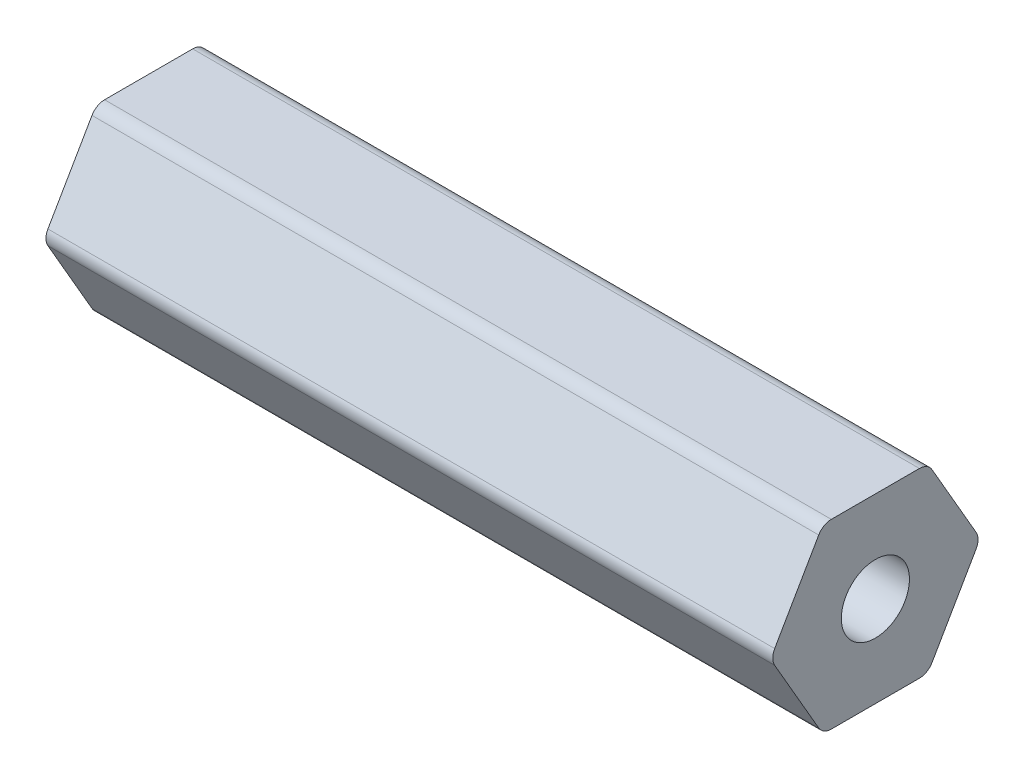
ISO-10303-21;
HEADER;
FILE_DESCRIPTION(('STEP AP214'),'2;1');
FILE_NAME('part.step','',(''),(''),'','','');
FILE_SCHEMA(('AUTOMOTIVE_DESIGN { 1 0 10303 214 1 1 1 1 }'));
ENDSEC;
DATA;
#1=APPLICATION_CONTEXT('core data for automotive mechanical design processes');
#2=APPLICATION_PROTOCOL_DEFINITION('international standard','automotive_design',2000,#1);
#3=PRODUCT_CONTEXT('',#1,'mechanical');
#4=PRODUCT('Part','Part','',(#3));
#5=PRODUCT_RELATED_PRODUCT_CATEGORY('part','',(#4));
#6=PRODUCT_DEFINITION_FORMATION('','',#4);
#7=PRODUCT_DEFINITION_CONTEXT('part definition',#1,'design');
#8=PRODUCT_DEFINITION('design','',#6,#7);
#9=PRODUCT_DEFINITION_SHAPE('','',#8);
#10=(LENGTH_UNIT() NAMED_UNIT(*) SI_UNIT(.MILLI.,.METRE.));
#11=(NAMED_UNIT(*) PLANE_ANGLE_UNIT() SI_UNIT($,.RADIAN.));
#12=(NAMED_UNIT(*) SI_UNIT($,.STERADIAN.) SOLID_ANGLE_UNIT());
#13=UNCERTAINTY_MEASURE_WITH_UNIT(LENGTH_MEASURE(1.E-05),#10,'distance_accuracy_value','');
#14=(GEOMETRIC_REPRESENTATION_CONTEXT(3) GLOBAL_UNCERTAINTY_ASSIGNED_CONTEXT((#13)) GLOBAL_UNIT_ASSIGNED_CONTEXT((#10,
#11,#12)) REPRESENTATION_CONTEXT('',''));
#15=CARTESIAN_POINT('',(0.,0.,0.));
#16=DIRECTION('',(0.,0.,1.));
#17=DIRECTION('',(1.,0.,0.));
#18=AXIS2_PLACEMENT_3D('',#15,#16,#17);
#19=CARTESIAN_POINT('',(50.8,5.334,-3.07958633585748));
#20=DIRECTION('',(-1.,0.,0.));
#21=DIRECTION('',(0.,0.,1.));
#22=AXIS2_PLACEMENT_3D('',#19,#20,#21);
#23=PLANE('',#22);
#24=CARTESIAN_POINT('',(50.8,5.334,-3.07958633585748));
#25=DIRECTION('',(1.,0.,0.));
#26=DIRECTION('',(0.,0.,1.));
#27=AXIS2_PLACEMENT_3D('',#24,#25,#26);
#28=CIRCLE('',#27,1.016);
#29=CARTESIAN_POINT('',(50.8,5.84199999999999,-3.95946814610247));
#30=VERTEX_POINT('',#29);
#31=CARTESIAN_POINT('',(50.8,6.34999999999999,-3.07958633585748));
#32=VERTEX_POINT('',#31);
#33=EDGE_CURVE('E206',#30,#32,#28,.T.);
#34=ORIENTED_EDGE('',*,*,#33,.T.);
#35=DIRECTION('',(0.,0.,1.));
#36=VECTOR('',#35,1.);
#37=CARTESIAN_POINT('',(50.8,6.34999999999999,-3.07958633585748));
#38=LINE('',#37,#36);
#39=CARTESIAN_POINT('',(50.8,6.35000000000001,3.07958633585745));
#40=VERTEX_POINT('',#39);
#41=EDGE_CURVE('E118',#32,#40,#38,.T.);
#42=ORIENTED_EDGE('',*,*,#41,.T.);
#43=CARTESIAN_POINT('',(50.8,5.33400000000001,3.07958633585745));
#44=DIRECTION('',(1.,0.,0.));
#45=DIRECTION('',(0.,0.,1.));
#46=AXIS2_PLACEMENT_3D('',#43,#44,#45);
#47=CIRCLE('',#46,1.016);
#48=CARTESIAN_POINT('',(50.8,5.84200000000001,3.95946814610244));
#49=VERTEX_POINT('',#48);
#50=EDGE_CURVE('E243',#40,#49,#47,.T.);
#51=ORIENTED_EDGE('',*,*,#50,.T.);
#52=DIRECTION('',(0.,-0.866025403784437,0.500000000000003));
#53=VECTOR('',#52,1.);
#54=CARTESIAN_POINT('',(50.8,5.84200000000001,3.95946814610244));
#55=LINE('',#54,#53);
#56=CARTESIAN_POINT('',(50.8,0.508000000000022,7.03905448195992));
#57=VERTEX_POINT('',#56);
#58=EDGE_CURVE('E263',#49,#57,#55,.T.);
#59=ORIENTED_EDGE('',*,*,#58,.T.);
#60=CARTESIAN_POINT('',(50.8,0.,6.15917267171493));
#61=DIRECTION('',(1.,0.,0.));
#62=DIRECTION('',(0.,0.,1.));
#63=AXIS2_PLACEMENT_3D('',#60,#61,#62);
#64=CIRCLE('',#63,1.016);
#65=CARTESIAN_POINT('',(50.8,-0.50799999999998,7.03905448195993));
#66=VERTEX_POINT('',#65);
#67=EDGE_CURVE('E259',#57,#66,#64,.T.);
#68=ORIENTED_EDGE('',*,*,#67,.T.);
#69=DIRECTION('',(0.,-0.86602540378444,-0.499999999999998));
#70=VECTOR('',#69,1.);
#71=CARTESIAN_POINT('',(50.8,-0.507999999999979,7.03905448195992));
#72=LINE('',#71,#70);
#73=CARTESIAN_POINT('',(50.8,-5.84199999999999,3.95946814610247));
#74=VERTEX_POINT('',#73);
#75=EDGE_CURVE('E262',#66,#74,#72,.T.);
#76=ORIENTED_EDGE('',*,*,#75,.T.);
#77=CARTESIAN_POINT('',(50.8,-5.334,3.07958633585748));
#78=DIRECTION('',(1.,0.,0.));
#79=DIRECTION('',(0.,0.,1.));
#80=AXIS2_PLACEMENT_3D('',#77,#78,#79);
#81=CIRCLE('',#80,1.016);
#82=CARTESIAN_POINT('',(50.8,-6.35,3.07958633585748));
#83=VERTEX_POINT('',#82);
#84=EDGE_CURVE('E267',#74,#83,#81,.T.);
#85=ORIENTED_EDGE('',*,*,#84,.T.);
#86=DIRECTION('',(0.,0.,-1.));
#87=VECTOR('',#86,1.);
#88=CARTESIAN_POINT('',(50.8,-6.35,3.07958633585748));
#89=LINE('',#88,#87);
#90=CARTESIAN_POINT('',(50.8,-6.35000000000001,-3.07958633585745));
#91=VERTEX_POINT('',#90);
#92=EDGE_CURVE('E274',#83,#91,#89,.T.);
#93=ORIENTED_EDGE('',*,*,#92,.T.);
#94=CARTESIAN_POINT('',(50.8,-5.33400000000001,-3.07958633585745));
#95=DIRECTION('',(1.,0.,0.));
#96=DIRECTION('',(0.,0.,1.));
#97=AXIS2_PLACEMENT_3D('',#94,#95,#96);
#98=CIRCLE('',#97,1.016);
#99=CARTESIAN_POINT('',(50.8,-5.84200000000001,-3.95946814610244));
#100=VERTEX_POINT('',#99);
#101=EDGE_CURVE('E149',#91,#100,#98,.T.);
#102=ORIENTED_EDGE('',*,*,#101,.T.);
#103=DIRECTION('',(0.,0.866025403784437,-0.500000000000002));
#104=VECTOR('',#103,1.);
#105=CARTESIAN_POINT('',(50.8,-5.84200000000001,-3.95946814610244));
#106=LINE('',#105,#104);
#107=CARTESIAN_POINT('',(50.8,-0.508000000000019,-7.03905448195992));
#108=VERTEX_POINT('',#107);
#109=EDGE_CURVE('E143',#100,#108,#106,.T.);
#110=ORIENTED_EDGE('',*,*,#109,.T.);
#111=CARTESIAN_POINT('',(50.8,0.,-6.15917267171493));
#112=DIRECTION('',(1.,0.,0.));
#113=DIRECTION('',(0.,0.,1.));
#114=AXIS2_PLACEMENT_3D('',#111,#112,#113);
#115=CIRCLE('',#114,1.016);
#116=CARTESIAN_POINT('',(50.8,0.507999999999981,-7.03905448195992));
#117=VERTEX_POINT('',#116);
#118=EDGE_CURVE('E147',#108,#117,#115,.T.);
#119=ORIENTED_EDGE('',*,*,#118,.T.);
#120=DIRECTION('',(0.,0.86602540378444,0.499999999999997));
#121=VECTOR('',#120,1.);
#122=CARTESIAN_POINT('',(50.8,0.50799999999998,-7.03905448195992));
#123=LINE('',#122,#121);
#124=EDGE_CURVE('E63',#117,#30,#123,.T.);
#125=ORIENTED_EDGE('',*,*,#124,.T.);
#126=EDGE_LOOP('',(#34,#42,#51,#59,#68,#76,#85,#93,#102,#110,#119,#125));
#127=FACE_BOUND('',#126,.T.);
#128=CARTESIAN_POINT('',(50.8,0.,0.));
#129=DIRECTION('',(1.,0.,0.));
#130=DIRECTION('',(0.,0.,-1.));
#131=AXIS2_PLACEMENT_3D('',#128,#129,#130);
#132=CIRCLE('',#131,2.38125);
#133=CARTESIAN_POINT('',(50.8,0.,-2.38125));
#134=VERTEX_POINT('',#133);
#135=EDGE_CURVE('E176',#134,#134,#132,.T.);
#136=ORIENTED_EDGE('',*,*,#135,.F.);
#137=EDGE_LOOP('',(#136));
#138=FACE_BOUND('',#137,.T.);
#139=ADVANCED_FACE('F45',(#127,#138),#23,.F.);
#140=CARTESIAN_POINT('',(0.,5.334,-3.07958633585748));
#141=DIRECTION('',(-1.,0.,0.));
#142=DIRECTION('',(0.,0.,1.));
#143=AXIS2_PLACEMENT_3D('',#140,#141,#142);
#144=PLANE('',#143);
#145=CARTESIAN_POINT('',(0.,5.334,-3.07958633585748));
#146=DIRECTION('',(1.,0.,0.));
#147=DIRECTION('',(0.,0.,1.));
#148=AXIS2_PLACEMENT_3D('',#145,#146,#147);
#149=CIRCLE('',#148,1.016);
#150=CARTESIAN_POINT('',(0.,5.84199999999999,-3.95946814610247));
#151=VERTEX_POINT('',#150);
#152=CARTESIAN_POINT('',(0.,6.34999999999999,-3.07958633585748));
#153=VERTEX_POINT('',#152);
#154=EDGE_CURVE('E171',#151,#153,#149,.T.);
#155=ORIENTED_EDGE('',*,*,#154,.F.);
#156=DIRECTION('',(0.,0.86602540378444,0.499999999999997));
#157=VECTOR('',#156,1.);
#158=CARTESIAN_POINT('',(0.,0.50799999999998,-7.03905448195992));
#159=LINE('',#158,#157);
#160=CARTESIAN_POINT('',(0.,0.507999999999981,-7.03905448195992));
#161=VERTEX_POINT('',#160);
#162=EDGE_CURVE('E110',#161,#151,#159,.T.);
#163=ORIENTED_EDGE('',*,*,#162,.F.);
#164=CARTESIAN_POINT('',(0.,0.,-6.15917267171493));
#165=DIRECTION('',(1.,0.,0.));
#166=DIRECTION('',(0.,0.,1.));
#167=AXIS2_PLACEMENT_3D('',#164,#165,#166);
#168=CIRCLE('',#167,1.016);
#169=CARTESIAN_POINT('',(0.,-0.508000000000019,-7.03905448195992));
#170=VERTEX_POINT('',#169);
#171=EDGE_CURVE('E104',#170,#161,#168,.T.);
#172=ORIENTED_EDGE('',*,*,#171,.F.);
#173=DIRECTION('',(0.,0.866025403784437,-0.500000000000002));
#174=VECTOR('',#173,1.);
#175=CARTESIAN_POINT('',(0.,-5.84200000000001,-3.95946814610244));
#176=LINE('',#175,#174);
#177=CARTESIAN_POINT('',(0.,-5.84200000000001,-3.95946814610244));
#178=VERTEX_POINT('',#177);
#179=EDGE_CURVE('E158',#178,#170,#176,.T.);
#180=ORIENTED_EDGE('',*,*,#179,.F.);
#181=CARTESIAN_POINT('',(0.,-5.33400000000001,-3.07958633585745));
#182=DIRECTION('',(1.,0.,0.));
#183=DIRECTION('',(0.,0.,1.));
#184=AXIS2_PLACEMENT_3D('',#181,#182,#183);
#185=CIRCLE('',#184,1.016);
#186=CARTESIAN_POINT('',(0.,-6.35000000000001,-3.07958633585745));
#187=VERTEX_POINT('',#186);
#188=EDGE_CURVE('E197',#187,#178,#185,.T.);
#189=ORIENTED_EDGE('',*,*,#188,.F.);
#190=DIRECTION('',(0.,0.,-1.));
#191=VECTOR('',#190,1.);
#192=CARTESIAN_POINT('',(0.,-6.35,3.07958633585748));
#193=LINE('',#192,#191);
#194=CARTESIAN_POINT('',(0.,-6.35,3.07958633585748));
#195=VERTEX_POINT('',#194);
#196=EDGE_CURVE('E194',#195,#187,#193,.T.);
#197=ORIENTED_EDGE('',*,*,#196,.F.);
#198=CARTESIAN_POINT('',(0.,-5.334,3.07958633585748));
#199=DIRECTION('',(1.,0.,0.));
#200=DIRECTION('',(0.,0.,1.));
#201=AXIS2_PLACEMENT_3D('',#198,#199,#200);
#202=CIRCLE('',#201,1.016);
#203=CARTESIAN_POINT('',(0.,-5.84199999999999,3.95946814610247));
#204=VERTEX_POINT('',#203);
#205=EDGE_CURVE('E191',#204,#195,#202,.T.);
#206=ORIENTED_EDGE('',*,*,#205,.F.);
#207=DIRECTION('',(0.,-0.86602540378444,-0.499999999999998));
#208=VECTOR('',#207,1.);
#209=CARTESIAN_POINT('',(0.,-0.507999999999979,7.03905448195992));
#210=LINE('',#209,#208);
#211=CARTESIAN_POINT('',(0.,-0.50799999999998,7.03905448195993));
#212=VERTEX_POINT('',#211);
#213=EDGE_CURVE('E188',#212,#204,#210,.T.);
#214=ORIENTED_EDGE('',*,*,#213,.F.);
#215=CARTESIAN_POINT('',(0.,0.,6.15917267171493));
#216=DIRECTION('',(1.,0.,0.));
#217=DIRECTION('',(0.,0.,1.));
#218=AXIS2_PLACEMENT_3D('',#215,#216,#217);
#219=CIRCLE('',#218,1.016);
#220=CARTESIAN_POINT('',(0.,0.508000000000022,7.03905448195992));
#221=VERTEX_POINT('',#220);
#222=EDGE_CURVE('E185',#221,#212,#219,.T.);
#223=ORIENTED_EDGE('',*,*,#222,.F.);
#224=DIRECTION('',(0.,-0.866025403784437,0.500000000000003));
#225=VECTOR('',#224,1.);
#226=CARTESIAN_POINT('',(0.,5.84200000000001,3.95946814610244));
#227=LINE('',#226,#225);
#228=CARTESIAN_POINT('',(0.,5.84200000000001,3.95946814610244));
#229=VERTEX_POINT('',#228);
#230=EDGE_CURVE('E182',#229,#221,#227,.T.);
#231=ORIENTED_EDGE('',*,*,#230,.F.);
#232=CARTESIAN_POINT('',(0.,5.33400000000001,3.07958633585745));
#233=DIRECTION('',(1.,0.,0.));
#234=DIRECTION('',(0.,0.,1.));
#235=AXIS2_PLACEMENT_3D('',#232,#233,#234);
#236=CIRCLE('',#235,1.016);
#237=CARTESIAN_POINT('',(0.,6.35000000000001,3.07958633585745));
#238=VERTEX_POINT('',#237);
#239=EDGE_CURVE('E179',#238,#229,#236,.T.);
#240=ORIENTED_EDGE('',*,*,#239,.F.);
#241=DIRECTION('',(0.,0.,1.));
#242=VECTOR('',#241,1.);
#243=CARTESIAN_POINT('',(0.,6.34999999999999,-3.07958633585748));
#244=LINE('',#243,#242);
#245=EDGE_CURVE('E175',#153,#238,#244,.T.);
#246=ORIENTED_EDGE('',*,*,#245,.F.);
#247=EDGE_LOOP('',(#155,#163,#172,#180,#189,#197,#206,#214,#223,#231,#240,#246));
#248=FACE_BOUND('',#247,.T.);
#249=CARTESIAN_POINT('',(0.,0.,0.));
#250=DIRECTION('',(1.,0.,0.));
#251=DIRECTION('',(0.,0.,-1.));
#252=AXIS2_PLACEMENT_3D('',#249,#250,#251);
#253=CIRCLE('',#252,2.38125);
#254=CARTESIAN_POINT('',(0.,0.,-2.38125));
#255=VERTEX_POINT('',#254);
#256=EDGE_CURVE('E474',#255,#255,#253,.T.);
#257=ORIENTED_EDGE('',*,*,#256,.T.);
#258=EDGE_LOOP('',(#257));
#259=FACE_BOUND('',#258,.T.);
#260=ADVANCED_FACE('F247',(#248,#259),#144,.T.);
#261=CARTESIAN_POINT('',(50.8,5.334,-3.07958633585748));
#262=DIRECTION('',(-1.,0.,0.));
#263=DIRECTION('',(0.,0.,1.));
#264=AXIS2_PLACEMENT_3D('',#261,#262,#263);
#265=CYLINDRICAL_SURFACE('',#264,1.016);
#266=ORIENTED_EDGE('',*,*,#154,.T.);
#267=DIRECTION('',(-1.,0.,0.));
#268=VECTOR('',#267,1.);
#269=CARTESIAN_POINT('',(50.8,6.34999999999999,-3.07958633585748));
#270=LINE('',#269,#268);
#271=EDGE_CURVE('E11',#32,#153,#270,.T.);
#272=ORIENTED_EDGE('',*,*,#271,.F.);
#273=ORIENTED_EDGE('',*,*,#33,.F.);
#274=DIRECTION('',(-1.,0.,0.));
#275=VECTOR('',#274,1.);
#276=CARTESIAN_POINT('',(50.8,5.84199999999999,-3.95946814610247));
#277=LINE('',#276,#275);
#278=EDGE_CURVE('E167',#30,#151,#277,.T.);
#279=ORIENTED_EDGE('',*,*,#278,.T.);
#280=EDGE_LOOP('',(#266,#272,#273,#279));
#281=FACE_BOUND('',#280,.T.);
#282=ADVANCED_FACE('F47',(#281),#265,.T.);
#283=CARTESIAN_POINT('',(50.8,6.34999999999999,-3.07958633585748));
#284=DIRECTION('',(0.,-1.,0.));
#285=DIRECTION('',(0.,0.,-1.));
#286=AXIS2_PLACEMENT_3D('',#283,#284,#285);
#287=PLANE('',#286);
#288=ORIENTED_EDGE('',*,*,#245,.T.);
#289=DIRECTION('',(-1.,0.,0.));
#290=VECTOR('',#289,1.);
#291=CARTESIAN_POINT('',(50.8,6.35000000000001,3.07958633585745));
#292=LINE('',#291,#290);
#293=EDGE_CURVE('E55',#40,#238,#292,.T.);
#294=ORIENTED_EDGE('',*,*,#293,.F.);
#295=ORIENTED_EDGE('',*,*,#41,.F.);
#296=ORIENTED_EDGE('',*,*,#271,.T.);
#297=EDGE_LOOP('',(#288,#294,#295,#296));
#298=FACE_BOUND('',#297,.T.);
#299=ADVANCED_FACE('F310',(#298),#287,.F.);
#300=CARTESIAN_POINT('',(50.8,5.33400000000001,3.07958633585745));
#301=DIRECTION('',(-1.,0.,0.));
#302=DIRECTION('',(0.,0.,1.));
#303=AXIS2_PLACEMENT_3D('',#300,#301,#302);
#304=CYLINDRICAL_SURFACE('',#303,1.016);
#305=ORIENTED_EDGE('',*,*,#239,.T.);
#306=DIRECTION('',(-1.,0.,0.));
#307=VECTOR('',#306,1.);
#308=CARTESIAN_POINT('',(50.8,5.84200000000001,3.95946814610244));
#309=LINE('',#308,#307);
#310=EDGE_CURVE('E233',#49,#229,#309,.T.);
#311=ORIENTED_EDGE('',*,*,#310,.F.);
#312=ORIENTED_EDGE('',*,*,#50,.F.);
#313=ORIENTED_EDGE('',*,*,#293,.T.);
#314=EDGE_LOOP('',(#305,#311,#312,#313));
#315=FACE_BOUND('',#314,.T.);
#316=ADVANCED_FACE('F241',(#315),#304,.T.);
#317=CARTESIAN_POINT('',(50.8,5.84200000000001,3.95946814610244));
#318=DIRECTION('',(0.,-0.500000000000003,-0.866025403784437));
#319=DIRECTION('',(0.,0.866025403784437,-0.500000000000003));
#320=AXIS2_PLACEMENT_3D('',#317,#318,#319);
#321=PLANE('',#320);
#322=ORIENTED_EDGE('',*,*,#230,.T.);
#323=DIRECTION('',(-1.,0.,0.));
#324=VECTOR('',#323,1.);
#325=CARTESIAN_POINT('',(50.8,0.508000000000022,7.03905448195992));
#326=LINE('',#325,#324);
#327=EDGE_CURVE('E229',#57,#221,#326,.T.);
#328=ORIENTED_EDGE('',*,*,#327,.F.);
#329=ORIENTED_EDGE('',*,*,#58,.F.);
#330=ORIENTED_EDGE('',*,*,#310,.T.);
#331=EDGE_LOOP('',(#322,#328,#329,#330));
#332=FACE_BOUND('',#331,.T.);
#333=ADVANCED_FACE('F253',(#332),#321,.F.);
#334=CARTESIAN_POINT('',(50.8,0.,6.15917267171493));
#335=DIRECTION('',(-1.,0.,0.));
#336=DIRECTION('',(0.,0.,1.));
#337=AXIS2_PLACEMENT_3D('',#334,#335,#336);
#338=CYLINDRICAL_SURFACE('',#337,1.016);
#339=ORIENTED_EDGE('',*,*,#222,.T.);
#340=DIRECTION('',(-1.,0.,0.));
#341=VECTOR('',#340,1.);
#342=CARTESIAN_POINT('',(50.8,-0.50799999999998,7.03905448195993));
#343=LINE('',#342,#341);
#344=EDGE_CURVE('E225',#66,#212,#343,.T.);
#345=ORIENTED_EDGE('',*,*,#344,.F.);
#346=ORIENTED_EDGE('',*,*,#67,.F.);
#347=ORIENTED_EDGE('',*,*,#327,.T.);
#348=EDGE_LOOP('',(#339,#345,#346,#347));
#349=FACE_BOUND('',#348,.T.);
#350=ADVANCED_FACE('F257',(#349),#338,.T.);
#351=CARTESIAN_POINT('',(50.8,-0.507999999999979,7.03905448195992));
#352=DIRECTION('',(0.,0.499999999999998,-0.86602540378444));
#353=DIRECTION('',(0.,0.86602540378444,0.499999999999998));
#354=AXIS2_PLACEMENT_3D('',#351,#352,#353);
#355=PLANE('',#354);
#356=ORIENTED_EDGE('',*,*,#213,.T.);
#357=DIRECTION('',(-1.,0.,0.));
#358=VECTOR('',#357,1.);
#359=CARTESIAN_POINT('',(50.8,-5.84199999999999,3.95946814610247));
#360=LINE('',#359,#358);
#361=EDGE_CURVE('E221',#74,#204,#360,.T.);
#362=ORIENTED_EDGE('',*,*,#361,.F.);
#363=ORIENTED_EDGE('',*,*,#75,.F.);
#364=ORIENTED_EDGE('',*,*,#344,.T.);
#365=EDGE_LOOP('',(#356,#362,#363,#364));
#366=FACE_BOUND('',#365,.T.);
#367=ADVANCED_FACE('F323',(#366),#355,.F.);
#368=CARTESIAN_POINT('',(50.8,-5.334,3.07958633585748));
#369=DIRECTION('',(-1.,0.,0.));
#370=DIRECTION('',(0.,0.,1.));
#371=AXIS2_PLACEMENT_3D('',#368,#369,#370);
#372=CYLINDRICAL_SURFACE('',#371,1.016);
#373=ORIENTED_EDGE('',*,*,#205,.T.);
#374=DIRECTION('',(-1.,0.,0.));
#375=VECTOR('',#374,1.);
#376=CARTESIAN_POINT('',(50.8,-6.35,3.07958633585748));
#377=LINE('',#376,#375);
#378=EDGE_CURVE('E217',#83,#195,#377,.T.);
#379=ORIENTED_EDGE('',*,*,#378,.F.);
#380=ORIENTED_EDGE('',*,*,#84,.F.);
#381=ORIENTED_EDGE('',*,*,#361,.T.);
#382=EDGE_LOOP('',(#373,#379,#380,#381));
#383=FACE_BOUND('',#382,.T.);
#384=ADVANCED_FACE('F326',(#383),#372,.T.);
#385=CARTESIAN_POINT('',(50.8,-6.35,3.07958633585748));
#386=DIRECTION('',(0.,1.,0.));
#387=DIRECTION('',(0.,0.,1.));
#388=AXIS2_PLACEMENT_3D('',#385,#386,#387);
#389=PLANE('',#388);
#390=ORIENTED_EDGE('',*,*,#196,.T.);
#391=DIRECTION('',(-1.,0.,0.));
#392=VECTOR('',#391,1.);
#393=CARTESIAN_POINT('',(50.8,-6.35000000000001,-3.07958633585745));
#394=LINE('',#393,#392);
#395=EDGE_CURVE('E213',#91,#187,#394,.T.);
#396=ORIENTED_EDGE('',*,*,#395,.F.);
#397=ORIENTED_EDGE('',*,*,#92,.F.);
#398=ORIENTED_EDGE('',*,*,#378,.T.);
#399=EDGE_LOOP('',(#390,#396,#397,#398));
#400=FACE_BOUND('',#399,.T.);
#401=ADVANCED_FACE('F282',(#400),#389,.F.);
#402=CARTESIAN_POINT('',(50.8,-5.33400000000001,-3.07958633585745));
#403=DIRECTION('',(-1.,0.,0.));
#404=DIRECTION('',(0.,0.,1.));
#405=AXIS2_PLACEMENT_3D('',#402,#403,#404);
#406=CYLINDRICAL_SURFACE('',#405,1.016);
#407=ORIENTED_EDGE('',*,*,#188,.T.);
#408=DIRECTION('',(-1.,0.,0.));
#409=VECTOR('',#408,1.);
#410=CARTESIAN_POINT('',(50.8,-5.84200000000001,-3.95946814610244));
#411=LINE('',#410,#409);
#412=EDGE_CURVE('E160',#100,#178,#411,.T.);
#413=ORIENTED_EDGE('',*,*,#412,.F.);
#414=ORIENTED_EDGE('',*,*,#101,.F.);
#415=ORIENTED_EDGE('',*,*,#395,.T.);
#416=EDGE_LOOP('',(#407,#413,#414,#415));
#417=FACE_BOUND('',#416,.T.);
#418=ADVANCED_FACE('F286',(#417),#406,.T.);
#419=CARTESIAN_POINT('',(50.8,-5.84200000000001,-3.95946814610244));
#420=DIRECTION('',(0.,0.500000000000002,0.866025403784437));
#421=DIRECTION('',(0.,-0.866025403784437,0.500000000000002));
#422=AXIS2_PLACEMENT_3D('',#419,#420,#421);
#423=PLANE('',#422);
#424=ORIENTED_EDGE('',*,*,#179,.T.);
#425=DIRECTION('',(-1.,0.,0.));
#426=VECTOR('',#425,1.);
#427=CARTESIAN_POINT('',(50.8,-0.508000000000019,-7.03905448195992));
#428=LINE('',#427,#426);
#429=EDGE_CURVE('E155',#108,#170,#428,.T.);
#430=ORIENTED_EDGE('',*,*,#429,.F.);
#431=ORIENTED_EDGE('',*,*,#109,.F.);
#432=ORIENTED_EDGE('',*,*,#412,.T.);
#433=EDGE_LOOP('',(#424,#430,#431,#432));
#434=FACE_BOUND('',#433,.T.);
#435=ADVANCED_FACE('F156',(#434),#423,.F.);
#436=CARTESIAN_POINT('',(50.8,0.,-6.15917267171493));
#437=DIRECTION('',(-1.,0.,0.));
#438=DIRECTION('',(0.,0.,1.));
#439=AXIS2_PLACEMENT_3D('',#436,#437,#438);
#440=CYLINDRICAL_SURFACE('',#439,1.016);
#441=ORIENTED_EDGE('',*,*,#171,.T.);
#442=DIRECTION('',(-1.,0.,0.));
#443=VECTOR('',#442,1.);
#444=CARTESIAN_POINT('',(50.8,0.507999999999981,-7.03905448195992));
#445=LINE('',#444,#443);
#446=EDGE_CURVE('E161',#117,#161,#445,.T.);
#447=ORIENTED_EDGE('',*,*,#446,.F.);
#448=ORIENTED_EDGE('',*,*,#118,.F.);
#449=ORIENTED_EDGE('',*,*,#429,.T.);
#450=EDGE_LOOP('',(#441,#447,#448,#449));
#451=FACE_BOUND('',#450,.T.);
#452=ADVANCED_FACE('F163',(#451),#440,.T.);
#453=CARTESIAN_POINT('',(50.8,0.50799999999998,-7.03905448195992));
#454=DIRECTION('',(0.,-0.499999999999997,0.86602540378444));
#455=DIRECTION('',(0.,-0.86602540378444,-0.499999999999998));
#456=AXIS2_PLACEMENT_3D('',#453,#454,#455);
#457=PLANE('',#456);
#458=ORIENTED_EDGE('',*,*,#162,.T.);
#459=ORIENTED_EDGE('',*,*,#278,.F.);
#460=ORIENTED_EDGE('',*,*,#124,.F.);
#461=ORIENTED_EDGE('',*,*,#446,.T.);
#462=EDGE_LOOP('',(#458,#459,#460,#461));
#463=FACE_BOUND('',#462,.T.);
#464=ADVANCED_FACE('F290',(#463),#457,.F.);
#465=CARTESIAN_POINT('',(50.8,0.,0.));
#466=DIRECTION('',(-1.,0.,0.));
#467=DIRECTION('',(0.,0.,1.));
#468=AXIS2_PLACEMENT_3D('',#465,#466,#467);
#469=CYLINDRICAL_SURFACE('',#468,2.38125);
#470=ORIENTED_EDGE('',*,*,#135,.T.);
#471=EDGE_LOOP('',(#470));
#472=FACE_BOUND('',#471,.T.);
#473=ORIENTED_EDGE('',*,*,#256,.F.);
#474=EDGE_LOOP('',(#473));
#475=FACE_BOUND('',#474,.T.);
#476=ADVANCED_FACE('F292',(#472,#475),#469,.F.);
#477=CLOSED_SHELL('',(#139,#260,#282,#299,#316,#333,#350,#367,#384,#401,#418,#435,#452,#464,#476));
#478=MANIFOLD_SOLID_BREP('B2',#477);
#479=ADVANCED_BREP_SHAPE_REPRESENTATION('',(#18,#478),#14);
#480=SHAPE_DEFINITION_REPRESENTATION(#9,#479);
ENDSEC;
END-ISO-10303-21;
